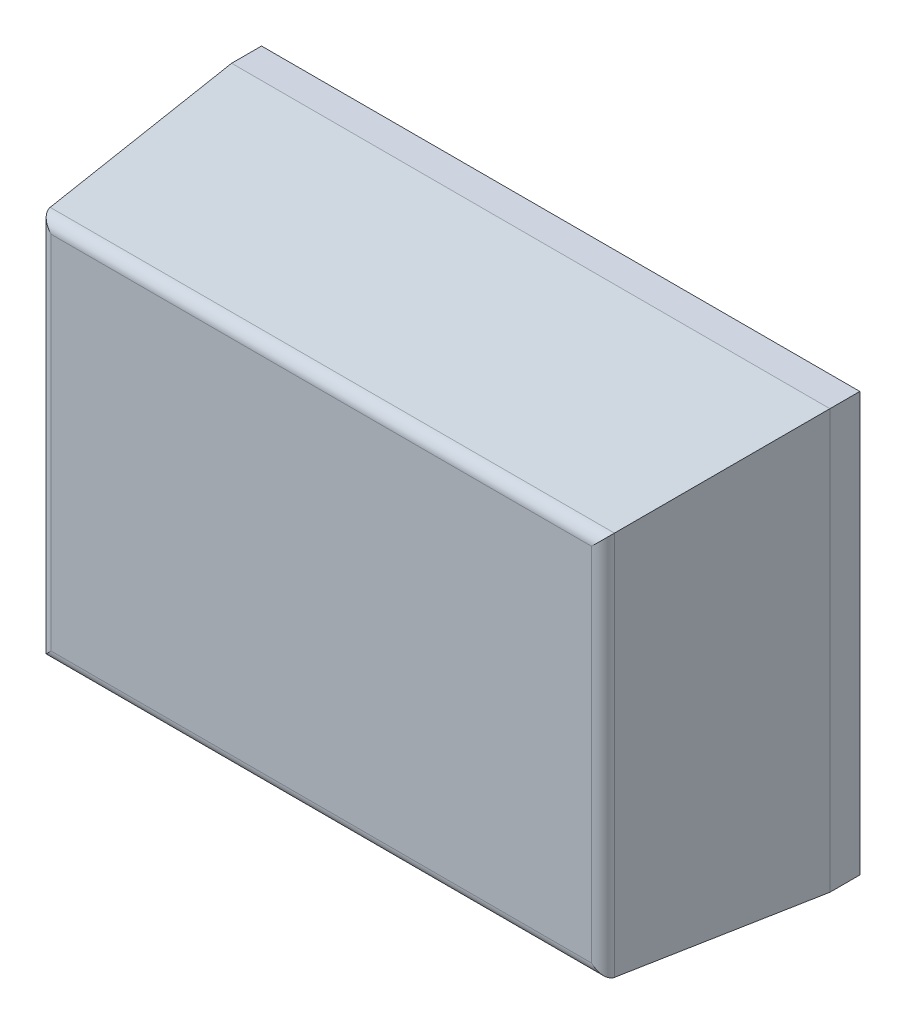
ISO-10303-21;
HEADER;
FILE_DESCRIPTION(('STEP AP214'),'2;1');
FILE_NAME('part.step','',(''),(''),'','','');
FILE_SCHEMA(('AUTOMOTIVE_DESIGN { 1 0 10303 214 1 1 1 1 }'));
ENDSEC;
DATA;
#1=APPLICATION_CONTEXT('core data for automotive mechanical design processes');
#2=APPLICATION_PROTOCOL_DEFINITION('international standard','automotive_design',2000,#1);
#3=PRODUCT_CONTEXT('',#1,'mechanical');
#4=PRODUCT('Part','Part','',(#3));
#5=PRODUCT_RELATED_PRODUCT_CATEGORY('part','',(#4));
#6=PRODUCT_DEFINITION_FORMATION('','',#4);
#7=PRODUCT_DEFINITION_CONTEXT('part definition',#1,'design');
#8=PRODUCT_DEFINITION('design','',#6,#7);
#9=PRODUCT_DEFINITION_SHAPE('','',#8);
#10=(LENGTH_UNIT() NAMED_UNIT(*) SI_UNIT(.MILLI.,.METRE.));
#11=(NAMED_UNIT(*) PLANE_ANGLE_UNIT() SI_UNIT($,.RADIAN.));
#12=(NAMED_UNIT(*) SI_UNIT($,.STERADIAN.) SOLID_ANGLE_UNIT());
#13=UNCERTAINTY_MEASURE_WITH_UNIT(LENGTH_MEASURE(1.E-05),#10,'distance_accuracy_value','');
#14=(GEOMETRIC_REPRESENTATION_CONTEXT(3) GLOBAL_UNCERTAINTY_ASSIGNED_CONTEXT((#13)) GLOBAL_UNIT_ASSIGNED_CONTEXT((#10,
#11,#12)) REPRESENTATION_CONTEXT('',''));
#15=CARTESIAN_POINT('',(0.,0.,0.));
#16=DIRECTION('',(0.,0.,1.));
#17=DIRECTION('',(1.,0.,0.));
#18=AXIS2_PLACEMENT_3D('',#15,#16,#17);
#19=CARTESIAN_POINT('',(-0.49999999999999,0.35,0.6));
#20=DIRECTION('',(0.,0.,1.));
#21=DIRECTION('',(1.,0.,0.));
#22=AXIS2_PLACEMENT_3D('',#19,#20,#21);
#23=PLANE('',#22);
#24=DIRECTION('',(1.,0.,0.));
#25=VECTOR('',#24,1.);
#26=CARTESIAN_POINT('',(-0.469999999999992,0.301640950776998,0.6));
#27=LINE('',#26,#25);
#28=CARTESIAN_POINT('',(-0.451640950777,0.301640950777001,0.6));
#29=VERTEX_POINT('',#28);
#30=CARTESIAN_POINT('',(0.451640950777008,0.301640950777001,0.6));
#31=VERTEX_POINT('',#30);
#32=EDGE_CURVE('E79',#29,#31,#27,.T.);
#33=ORIENTED_EDGE('',*,*,#32,.F.);
#34=DIRECTION('',(0.,1.,0.));
#35=VECTOR('',#34,1.);
#36=CARTESIAN_POINT('',(-0.451640950776991,-0.320000000000001,0.6));
#37=LINE('',#36,#35);
#38=CARTESIAN_POINT('',(-0.451640950776991,-0.301640950777039,0.6));
#39=VERTEX_POINT('',#38);
#40=EDGE_CURVE('E82',#39,#29,#37,.T.);
#41=ORIENTED_EDGE('',*,*,#40,.F.);
#42=DIRECTION('',(-1.,0.,0.));
#43=VECTOR('',#42,1.);
#44=CARTESIAN_POINT('',(0.470000000000001,-0.301640950777067,0.6));
#45=LINE('',#44,#43);
#46=CARTESIAN_POINT('',(0.451640950777012,-0.301640950777001,0.6));
#47=VERTEX_POINT('',#46);
#48=EDGE_CURVE('E96',#47,#39,#45,.T.);
#49=ORIENTED_EDGE('',*,*,#48,.F.);
#50=DIRECTION('',(0.,-1.,0.));
#51=VECTOR('',#50,1.);
#52=CARTESIAN_POINT('',(0.451640950777012,0.320000000000001,0.6));
#53=LINE('',#52,#51);
#54=EDGE_CURVE('E84',#31,#47,#53,.T.);
#55=ORIENTED_EDGE('',*,*,#54,.F.);
#56=EDGE_LOOP('',(#33,#41,#49,#55));
#57=FACE_BOUND('',#56,.T.);
#58=ADVANCED_FACE('F17',(#57),#23,.T.);
#59=CARTESIAN_POINT('',(-0.469999999999992,0.301640950776998,0.58));
#60=DIRECTION('',(1.,0.,0.));
#61=DIRECTION('',(0.,0.,-1.));
#62=AXIS2_PLACEMENT_3D('',#59,#60,#61);
#63=CYLINDRICAL_SURFACE('',#62,0.02);
#64=CARTESIAN_POINT('',(-0.451640950777,0.301640950777001,0.58));
#65=DIRECTION('',(0.70710678118655,0.707106781186547,0.));
#66=DIRECTION('',(-0.707106781186547,0.70710678118655,0.));
#67=AXIS2_PLACEMENT_3D('',#64,#65,#66);
#68=ELLIPSE('',#67,0.0282842712474619,0.02);
#69=CARTESIAN_POINT('',(-0.471567883757684,0.32156788375785,0.581708022826974));
#70=VERTEX_POINT('',#69);
#71=EDGE_CURVE('E20',#29,#70,#68,.F.);
#72=ORIENTED_EDGE('',*,*,#71,.F.);
#73=ORIENTED_EDGE('',*,*,#32,.T.);
#74=CARTESIAN_POINT('',(0.451640950777008,0.301640950777001,0.58));
#75=DIRECTION('',(0.707106781186547,-0.70710678118655,0.));
#76=DIRECTION('',(-0.70710678118655,-0.707106781186547,0.));
#77=AXIS2_PLACEMENT_3D('',#74,#75,#76);
#78=ELLIPSE('',#77,0.0282842712474619,0.02);
#79=CARTESIAN_POINT('',(0.471567883757694,0.321567883757846,0.581708022826974));
#80=VERTEX_POINT('',#79);
#81=EDGE_CURVE('E102',#80,#31,#78,.T.);
#82=ORIENTED_EDGE('',*,*,#81,.F.);
#83=DIRECTION('',(1.,0.,0.));
#84=VECTOR('',#83,1.);
#85=CARTESIAN_POINT('',(-0.5,0.321567883757694,0.581708022826974));
#86=LINE('',#85,#84);
#87=EDGE_CURVE('E100',#70,#80,#86,.T.);
#88=ORIENTED_EDGE('',*,*,#87,.F.);
#89=EDGE_LOOP('',(#72,#73,#82,#88));
#90=FACE_BOUND('',#89,.T.);
#91=ADVANCED_FACE('F99',(#90),#63,.T.);
#92=CARTESIAN_POINT('',(-0.451640950776991,-0.320000000000001,0.58));
#93=DIRECTION('',(0.,1.,0.));
#94=DIRECTION('',(0.,0.,1.));
#95=AXIS2_PLACEMENT_3D('',#92,#93,#94);
#96=CYLINDRICAL_SURFACE('',#95,0.02);
#97=CARTESIAN_POINT('',(-0.451640950776991,-0.301640950777039,0.58));
#98=DIRECTION('',(-0.707106781186547,0.70710678118655,0.));
#99=DIRECTION('',(-0.70710678118655,-0.707106781186547,0.));
#100=AXIS2_PLACEMENT_3D('',#97,#98,#99);
#101=ELLIPSE('',#100,0.0282842712474619,0.02);
#102=CARTESIAN_POINT('',(-0.471567883757839,-0.321567883757694,0.581708022826974));
#103=VERTEX_POINT('',#102);
#104=EDGE_CURVE('E95',#39,#103,#101,.F.);
#105=ORIENTED_EDGE('',*,*,#104,.F.);
#106=ORIENTED_EDGE('',*,*,#40,.T.);
#107=ORIENTED_EDGE('',*,*,#71,.T.);
#108=DIRECTION('',(0.,1.,0.));
#109=VECTOR('',#108,1.);
#110=CARTESIAN_POINT('',(-0.471567883757677,-0.35,0.581708022826974));
#111=LINE('',#110,#109);
#112=EDGE_CURVE('E107',#103,#70,#111,.T.);
#113=ORIENTED_EDGE('',*,*,#112,.F.);
#114=EDGE_LOOP('',(#105,#106,#107,#113));
#115=FACE_BOUND('',#114,.T.);
#116=ADVANCED_FACE('F92',(#115),#96,.T.);
#117=CARTESIAN_POINT('',(0.470000000000001,-0.301640950777067,0.58));
#118=DIRECTION('',(-1.,0.,0.));
#119=DIRECTION('',(0.,0.,1.));
#120=AXIS2_PLACEMENT_3D('',#117,#118,#119);
#121=CYLINDRICAL_SURFACE('',#120,0.02);
#122=ORIENTED_EDGE('',*,*,#48,.T.);
#123=ORIENTED_EDGE('',*,*,#104,.T.);
#124=DIRECTION('',(1.,0.,0.));
#125=VECTOR('',#124,1.);
#126=CARTESIAN_POINT('',(0.500000000000009,-0.321567883757694,0.581708022826974));
#127=LINE('',#126,#125);
#128=CARTESIAN_POINT('',(0.471567883757694,-0.321567883757781,0.581708022826974));
#129=VERTEX_POINT('',#128);
#130=EDGE_CURVE('E117',#129,#103,#127,.F.);
#131=ORIENTED_EDGE('',*,*,#130,.F.);
#132=CARTESIAN_POINT('',(0.451640950777012,-0.301640950777001,0.58));
#133=DIRECTION('',(-0.70710678118655,-0.707106781186547,0.));
#134=DIRECTION('',(0.707106781186547,-0.70710678118655,0.));
#135=AXIS2_PLACEMENT_3D('',#132,#133,#134);
#136=ELLIPSE('',#135,0.0282842712474619,0.02);
#137=EDGE_CURVE('E108',#47,#129,#136,.F.);
#138=ORIENTED_EDGE('',*,*,#137,.F.);
#139=EDGE_LOOP('',(#122,#123,#131,#138));
#140=FACE_BOUND('',#139,.T.);
#141=ADVANCED_FACE('F191',(#140),#121,.T.);
#142=CARTESIAN_POINT('',(0.451640950777012,0.320000000000001,0.58));
#143=DIRECTION('',(0.,-1.,0.));
#144=DIRECTION('',(0.,0.,-1.));
#145=AXIS2_PLACEMENT_3D('',#142,#143,#144);
#146=CYLINDRICAL_SURFACE('',#145,0.02);
#147=ORIENTED_EDGE('',*,*,#54,.T.);
#148=ORIENTED_EDGE('',*,*,#137,.T.);
#149=DIRECTION('',(0.,1.,0.));
#150=VECTOR('',#149,1.);
#151=CARTESIAN_POINT('',(0.471567883757694,0.35,0.581708022826974));
#152=LINE('',#151,#150);
#153=EDGE_CURVE('E137',#80,#129,#152,.F.);
#154=ORIENTED_EDGE('',*,*,#153,.F.);
#155=ORIENTED_EDGE('',*,*,#81,.T.);
#156=EDGE_LOOP('',(#147,#148,#154,#155));
#157=FACE_BOUND('',#156,.T.);
#158=ADVANCED_FACE('F192',(#157),#146,.T.);
#159=CARTESIAN_POINT('',(-0.499999999999993,0.334999999999999,0.425));
#160=DIRECTION('',(0.,0.996346649041756,0.085401141346399));
#161=DIRECTION('',(0.,-0.0854011413463992,0.996346649041754));
#162=AXIS2_PLACEMENT_3D('',#159,#160,#161);
#163=PLANE('',#162);
#164=ORIENTED_EDGE('',*,*,#87,.T.);
#165=DIRECTION('',(-0.0850914041695801,-0.0850914041686832,0.992733048645531));
#166=VECTOR('',#165,1.);
#167=CARTESIAN_POINT('',(0.499999999999994,0.350000000000069,0.249999999999999));
#168=LINE('',#167,#166);
#169=CARTESIAN_POINT('',(0.499999999999994,0.350000000000069,0.249999999999999));
#170=VERTEX_POINT('',#169);
#171=EDGE_CURVE('E133',#170,#80,#168,.T.);
#172=ORIENTED_EDGE('',*,*,#171,.F.);
#173=DIRECTION('',(1.,0.,0.));
#174=VECTOR('',#173,1.);
#175=CARTESIAN_POINT('',(-0.49999999999999,0.35,0.25));
#176=LINE('',#175,#174);
#177=CARTESIAN_POINT('',(-0.49999999999999,0.349999999999996,0.25));
#178=VERTEX_POINT('',#177);
#179=EDGE_CURVE('E113',#178,#170,#176,.T.);
#180=ORIENTED_EDGE('',*,*,#179,.F.);
#181=DIRECTION('',(-0.0850914041695804,0.0850914041686829,-0.992733048645531));
#182=VECTOR('',#181,1.);
#183=CARTESIAN_POINT('',(-0.471567883757684,0.321567883758003,0.581708022826974));
#184=LINE('',#183,#182);
#185=EDGE_CURVE('E111',#70,#178,#184,.T.);
#186=ORIENTED_EDGE('',*,*,#185,.F.);
#187=EDGE_LOOP('',(#164,#172,#180,#186));
#188=FACE_BOUND('',#187,.T.);
#189=ADVANCED_FACE('F112',(#188),#163,.T.);
#190=CARTESIAN_POINT('',(-0.48499999999999,-0.35,0.425));
#191=DIRECTION('',(-0.996346649041756,0.,0.085401141346399));
#192=DIRECTION('',(0.0854011413463992,0.,0.996346649041754));
#193=AXIS2_PLACEMENT_3D('',#190,#191,#192);
#194=PLANE('',#193);
#195=ORIENTED_EDGE('',*,*,#112,.T.);
#196=ORIENTED_EDGE('',*,*,#185,.T.);
#197=DIRECTION('',(0.,1.,0.));
#198=VECTOR('',#197,1.);
#199=CARTESIAN_POINT('',(-0.49999999999999,-0.35,0.25));
#200=LINE('',#199,#198);
#201=CARTESIAN_POINT('',(-0.499999999999987,-0.349999999999996,0.25));
#202=VERTEX_POINT('',#201);
#203=EDGE_CURVE('E176',#202,#178,#200,.T.);
#204=ORIENTED_EDGE('',*,*,#203,.F.);
#205=DIRECTION('',(-0.0850914041686829,-0.0850914041695804,-0.992733048645531));
#206=VECTOR('',#205,1.);
#207=CARTESIAN_POINT('',(-0.471567883757992,-0.321567883757694,0.581708022826974));
#208=LINE('',#207,#206);
#209=EDGE_CURVE('E120',#103,#202,#208,.T.);
#210=ORIENTED_EDGE('',*,*,#209,.F.);
#211=EDGE_LOOP('',(#195,#196,#204,#210));
#212=FACE_BOUND('',#211,.T.);
#213=ADVANCED_FACE('F200',(#212),#194,.T.);
#214=CARTESIAN_POINT('',(0.500000000000009,-0.334999999999999,0.425));
#215=DIRECTION('',(0.,-0.996346649041756,0.085401141346399));
#216=DIRECTION('',(0.,-0.0854011413463992,-0.996346649041754));
#217=AXIS2_PLACEMENT_3D('',#214,#215,#216);
#218=PLANE('',#217);
#219=ORIENTED_EDGE('',*,*,#130,.T.);
#220=ORIENTED_EDGE('',*,*,#209,.T.);
#221=DIRECTION('',(1.,0.,0.));
#222=VECTOR('',#221,1.);
#223=CARTESIAN_POINT('',(0.500000000000009,-0.35,0.25));
#224=LINE('',#223,#222);
#225=CARTESIAN_POINT('',(0.500000000000008,-0.349999999999996,0.25));
#226=VERTEX_POINT('',#225);
#227=EDGE_CURVE('E171',#226,#202,#224,.F.);
#228=ORIENTED_EDGE('',*,*,#227,.F.);
#229=DIRECTION('',(0.0850914041695804,-0.0850914041686829,-0.992733048645531));
#230=VECTOR('',#229,1.);
#231=CARTESIAN_POINT('',(0.471567883757694,-0.321567883757933,0.581708022826974));
#232=LINE('',#231,#230);
#233=EDGE_CURVE('E142',#129,#226,#232,.T.);
#234=ORIENTED_EDGE('',*,*,#233,.F.);
#235=EDGE_LOOP('',(#219,#220,#228,#234));
#236=FACE_BOUND('',#235,.T.);
#237=ADVANCED_FACE('F188',(#236),#218,.T.);
#238=CARTESIAN_POINT('',(0.485,0.35,0.425));
#239=DIRECTION('',(0.996346649041756,0.,0.085401141346399));
#240=DIRECTION('',(0.0854011413463992,0.,-0.996346649041754));
#241=AXIS2_PLACEMENT_3D('',#238,#239,#240);
#242=PLANE('',#241);
#243=ORIENTED_EDGE('',*,*,#153,.T.);
#244=ORIENTED_EDGE('',*,*,#233,.T.);
#245=DIRECTION('',(0.,1.,0.));
#246=VECTOR('',#245,1.);
#247=CARTESIAN_POINT('',(0.5,0.350000000000069,0.25));
#248=LINE('',#247,#246);
#249=EDGE_CURVE('E157',#170,#226,#248,.F.);
#250=ORIENTED_EDGE('',*,*,#249,.F.);
#251=ORIENTED_EDGE('',*,*,#171,.T.);
#252=EDGE_LOOP('',(#243,#244,#250,#251));
#253=FACE_BOUND('',#252,.T.);
#254=ADVANCED_FACE('F189',(#253),#242,.T.);
#255=CARTESIAN_POINT('',(-0.49999999999999,0.35,0.2));
#256=DIRECTION('',(0.,1.,0.));
#257=DIRECTION('',(0.,0.,1.));
#258=AXIS2_PLACEMENT_3D('',#255,#256,#257);
#259=PLANE('',#258);
#260=DIRECTION('',(0.,0.,1.));
#261=VECTOR('',#260,1.);
#262=CARTESIAN_POINT('',(-0.49999999999999,0.35,0.2));
#263=LINE('',#262,#261);
#264=CARTESIAN_POINT('',(-0.49999999999999,0.35,0.2));
#265=VERTEX_POINT('',#264);
#266=EDGE_CURVE('E151',#178,#265,#263,.F.);
#267=ORIENTED_EDGE('',*,*,#266,.F.);
#268=ORIENTED_EDGE('',*,*,#179,.T.);
#269=DIRECTION('',(0.,0.,-1.));
#270=VECTOR('',#269,1.);
#271=CARTESIAN_POINT('',(0.5,0.350000000000069,0.2));
#272=LINE('',#271,#270);
#273=CARTESIAN_POINT('',(0.5,0.350000000000069,0.2));
#274=VERTEX_POINT('',#273);
#275=EDGE_CURVE('E154',#274,#170,#272,.F.);
#276=ORIENTED_EDGE('',*,*,#275,.F.);
#277=DIRECTION('',(1.,0.,0.));
#278=VECTOR('',#277,1.);
#279=CARTESIAN_POINT('',(-0.49999999999999,0.35,0.2));
#280=LINE('',#279,#278);
#281=EDGE_CURVE('E159',#274,#265,#280,.F.);
#282=ORIENTED_EDGE('',*,*,#281,.T.);
#283=EDGE_LOOP('',(#267,#268,#276,#282));
#284=FACE_BOUND('',#283,.T.);
#285=ADVANCED_FACE('F215',(#284),#259,.T.);
#286=CARTESIAN_POINT('',(-0.49999999999999,-0.35,0.2));
#287=DIRECTION('',(-1.,0.,0.));
#288=DIRECTION('',(0.,0.,1.));
#289=AXIS2_PLACEMENT_3D('',#286,#287,#288);
#290=PLANE('',#289);
#291=DIRECTION('',(0.,0.,-1.));
#292=VECTOR('',#291,1.);
#293=CARTESIAN_POINT('',(-0.49999999999999,-0.35,0.2));
#294=LINE('',#293,#292);
#295=CARTESIAN_POINT('',(-0.49999999999999,-0.35,0.2));
#296=VERTEX_POINT('',#295);
#297=EDGE_CURVE('E174',#202,#296,#294,.T.);
#298=ORIENTED_EDGE('',*,*,#297,.F.);
#299=ORIENTED_EDGE('',*,*,#203,.T.);
#300=ORIENTED_EDGE('',*,*,#266,.T.);
#301=DIRECTION('',(0.,1.,0.));
#302=VECTOR('',#301,1.);
#303=CARTESIAN_POINT('',(-0.49999999999999,0.35,0.2));
#304=LINE('',#303,#302);
#305=EDGE_CURVE('E161',#265,#296,#304,.F.);
#306=ORIENTED_EDGE('',*,*,#305,.T.);
#307=EDGE_LOOP('',(#298,#299,#300,#306));
#308=FACE_BOUND('',#307,.T.);
#309=ADVANCED_FACE('F180',(#308),#290,.T.);
#310=CARTESIAN_POINT('',(0.500000000000009,-0.35,0.2));
#311=DIRECTION('',(0.,-1.,0.));
#312=DIRECTION('',(0.,0.,-1.));
#313=AXIS2_PLACEMENT_3D('',#310,#311,#312);
#314=PLANE('',#313);
#315=DIRECTION('',(0.,0.,-1.));
#316=VECTOR('',#315,1.);
#317=CARTESIAN_POINT('',(0.500000000000009,-0.35,0.2));
#318=LINE('',#317,#316);
#319=CARTESIAN_POINT('',(0.500000000000009,-0.35,0.2));
#320=VERTEX_POINT('',#319);
#321=EDGE_CURVE('E34',#226,#320,#318,.T.);
#322=ORIENTED_EDGE('',*,*,#321,.F.);
#323=ORIENTED_EDGE('',*,*,#227,.T.);
#324=ORIENTED_EDGE('',*,*,#297,.T.);
#325=DIRECTION('',(1.,0.,0.));
#326=VECTOR('',#325,1.);
#327=CARTESIAN_POINT('',(-0.49999999999999,-0.35,0.2));
#328=LINE('',#327,#326);
#329=EDGE_CURVE('E26',#296,#320,#328,.T.);
#330=ORIENTED_EDGE('',*,*,#329,.T.);
#331=EDGE_LOOP('',(#322,#323,#324,#330));
#332=FACE_BOUND('',#331,.T.);
#333=ADVANCED_FACE('F186',(#332),#314,.T.);
#334=CARTESIAN_POINT('',(0.5,0.350000000000069,0.2));
#335=DIRECTION('',(1.,0.,0.));
#336=DIRECTION('',(0.,0.,-1.));
#337=AXIS2_PLACEMENT_3D('',#334,#335,#336);
#338=PLANE('',#337);
#339=ORIENTED_EDGE('',*,*,#275,.T.);
#340=ORIENTED_EDGE('',*,*,#249,.T.);
#341=ORIENTED_EDGE('',*,*,#321,.T.);
#342=DIRECTION('',(0.,1.,0.));
#343=VECTOR('',#342,1.);
#344=CARTESIAN_POINT('',(0.5,0.350000000000069,0.2));
#345=LINE('',#344,#343);
#346=EDGE_CURVE('E11',#320,#274,#345,.T.);
#347=ORIENTED_EDGE('',*,*,#346,.T.);
#348=EDGE_LOOP('',(#339,#340,#341,#347));
#349=FACE_BOUND('',#348,.T.);
#350=ADVANCED_FACE('F204',(#349),#338,.T.);
#351=CARTESIAN_POINT('',(-0.49999999999999,0.35,0.2));
#352=DIRECTION('',(0.,0.,1.));
#353=DIRECTION('',(1.,0.,0.));
#354=AXIS2_PLACEMENT_3D('',#351,#352,#353);
#355=PLANE('',#354);
#356=ORIENTED_EDGE('',*,*,#329,.F.);
#357=ORIENTED_EDGE('',*,*,#305,.F.);
#358=ORIENTED_EDGE('',*,*,#281,.F.);
#359=ORIENTED_EDGE('',*,*,#346,.F.);
#360=EDGE_LOOP('',(#356,#357,#358,#359));
#361=FACE_BOUND('',#360,.T.);
#362=ADVANCED_FACE('F183',(#361),#355,.F.);
#363=CLOSED_SHELL('',(#58,#91,#116,#141,#158,#189,#213,#237,#254,#285,#309,#333,#350,#362));
#364=MANIFOLD_SOLID_BREP('B1',#363);
#365=ADVANCED_BREP_SHAPE_REPRESENTATION('',(#18,#364),#14);
#366=SHAPE_DEFINITION_REPRESENTATION(#9,#365);
ENDSEC;
END-ISO-10303-21;
